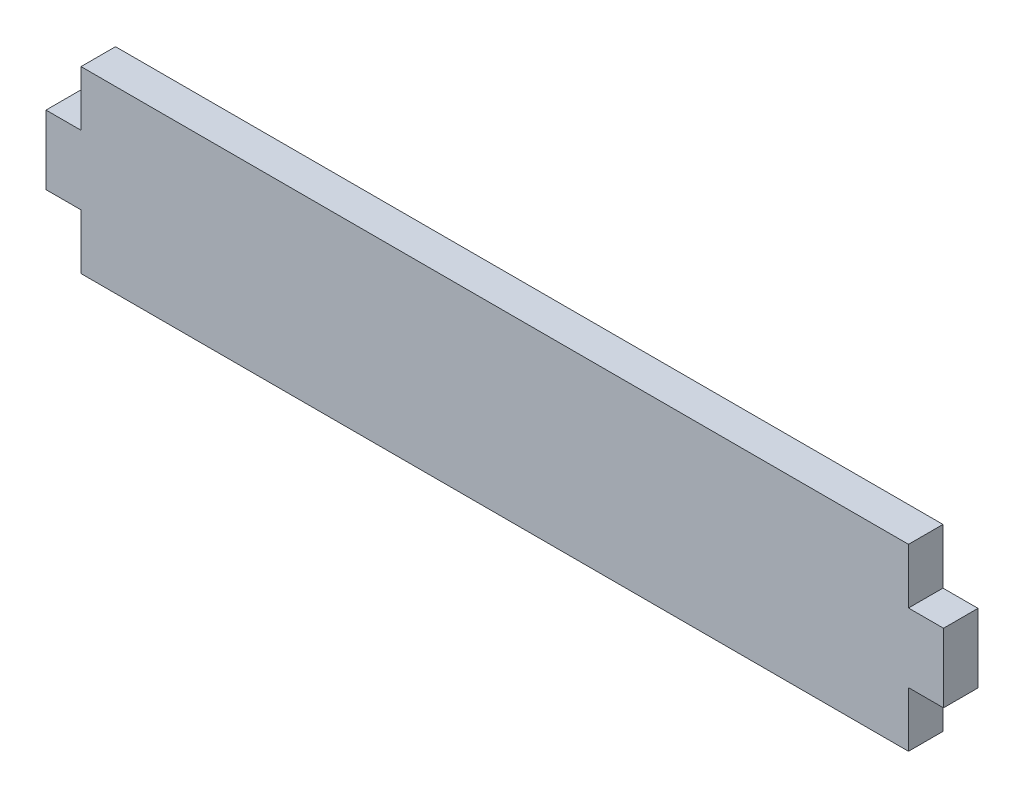
ISO-10303-21;
HEADER;
FILE_DESCRIPTION(('STEP AP214'),'2;1');
FILE_NAME('part.step','',(''),(''),'','','');
FILE_SCHEMA(('AUTOMOTIVE_DESIGN { 1 0 10303 214 1 1 1 1 }'));
ENDSEC;
DATA;
#1=APPLICATION_CONTEXT('core data for automotive mechanical design processes');
#2=APPLICATION_PROTOCOL_DEFINITION('international standard','automotive_design',2000,#1);
#3=PRODUCT_CONTEXT('',#1,'mechanical');
#4=PRODUCT('Part','Part','',(#3));
#5=PRODUCT_RELATED_PRODUCT_CATEGORY('part','',(#4));
#6=PRODUCT_DEFINITION_FORMATION('','',#4);
#7=PRODUCT_DEFINITION_CONTEXT('part definition',#1,'design');
#8=PRODUCT_DEFINITION('design','',#6,#7);
#9=PRODUCT_DEFINITION_SHAPE('','',#8);
#10=(LENGTH_UNIT() NAMED_UNIT(*) SI_UNIT(.MILLI.,.METRE.));
#11=(NAMED_UNIT(*) PLANE_ANGLE_UNIT() SI_UNIT($,.RADIAN.));
#12=(NAMED_UNIT(*) SI_UNIT($,.STERADIAN.) SOLID_ANGLE_UNIT());
#13=UNCERTAINTY_MEASURE_WITH_UNIT(LENGTH_MEASURE(1.E-05),#10,'distance_accuracy_value','');
#14=(GEOMETRIC_REPRESENTATION_CONTEXT(3) GLOBAL_UNCERTAINTY_ASSIGNED_CONTEXT((#13)) GLOBAL_UNIT_ASSIGNED_CONTEXT((#10,
#11,#12)) REPRESENTATION_CONTEXT('',''));
#15=CARTESIAN_POINT('',(0.,0.,0.));
#16=DIRECTION('',(0.,0.,1.));
#17=DIRECTION('',(1.,0.,0.));
#18=AXIS2_PLACEMENT_3D('',#15,#16,#17);
#19=CARTESIAN_POINT('',(38.1,-8.255,3.175));
#20=DIRECTION('',(-1.,0.,0.));
#21=DIRECTION('',(0.,0.,1.));
#22=AXIS2_PLACEMENT_3D('',#19,#20,#21);
#23=PLANE('',#22);
#24=DIRECTION('',(0.,0.,1.));
#25=VECTOR('',#24,1.);
#26=CARTESIAN_POINT('',(38.1,3.175,0.));
#27=LINE('',#26,#25);
#28=CARTESIAN_POINT('',(38.1,3.175,0.));
#29=VERTEX_POINT('',#28);
#30=CARTESIAN_POINT('',(38.1,3.175,3.175));
#31=VERTEX_POINT('',#30);
#32=EDGE_CURVE('E246',#29,#31,#27,.T.);
#33=ORIENTED_EDGE('',*,*,#32,.F.);
#34=DIRECTION('',(0.,1.,0.));
#35=VECTOR('',#34,1.);
#36=CARTESIAN_POINT('',(38.1,-8.255,0.));
#37=LINE('',#36,#35);
#38=CARTESIAN_POINT('',(38.1,8.255,0.));
#39=VERTEX_POINT('',#38);
#40=EDGE_CURVE('E148',#29,#39,#37,.T.);
#41=ORIENTED_EDGE('',*,*,#40,.T.);
#42=DIRECTION('',(0.,0.,-1.));
#43=VECTOR('',#42,1.);
#44=CARTESIAN_POINT('',(38.1,8.255,3.175));
#45=LINE('',#44,#43);
#46=CARTESIAN_POINT('',(38.1,8.255,3.175));
#47=VERTEX_POINT('',#46);
#48=EDGE_CURVE('E11',#47,#39,#45,.T.);
#49=ORIENTED_EDGE('',*,*,#48,.F.);
#50=DIRECTION('',(0.,1.,0.));
#51=VECTOR('',#50,1.);
#52=CARTESIAN_POINT('',(38.1,-8.255,3.175));
#53=LINE('',#52,#51);
#54=EDGE_CURVE('E200',#31,#47,#53,.T.);
#55=ORIENTED_EDGE('',*,*,#54,.F.);
#56=EDGE_LOOP('',(#33,#41,#49,#55));
#57=FACE_BOUND('',#56,.T.);
#58=ADVANCED_FACE('F33',(#57),#23,.F.);
#59=CARTESIAN_POINT('',(-38.1,-8.255,3.175));
#60=DIRECTION('',(1.,0.,0.));
#61=DIRECTION('',(0.,0.,-1.));
#62=AXIS2_PLACEMENT_3D('',#59,#60,#61);
#63=PLANE('',#62);
#64=DIRECTION('',(0.,0.,1.));
#65=VECTOR('',#64,1.);
#66=CARTESIAN_POINT('',(-38.1,-3.175,0.));
#67=LINE('',#66,#65);
#68=CARTESIAN_POINT('',(-38.1,-3.175,0.));
#69=VERTEX_POINT('',#68);
#70=CARTESIAN_POINT('',(-38.1,-3.175,3.175));
#71=VERTEX_POINT('',#70);
#72=EDGE_CURVE('E152',#69,#71,#67,.T.);
#73=ORIENTED_EDGE('',*,*,#72,.F.);
#74=DIRECTION('',(0.,-1.,0.));
#75=VECTOR('',#74,1.);
#76=CARTESIAN_POINT('',(-38.1,-8.255,0.));
#77=LINE('',#76,#75);
#78=CARTESIAN_POINT('',(-38.1,-8.255,0.));
#79=VERTEX_POINT('',#78);
#80=EDGE_CURVE('E150',#69,#79,#77,.T.);
#81=ORIENTED_EDGE('',*,*,#80,.T.);
#82=DIRECTION('',(0.,0.,-1.));
#83=VECTOR('',#82,1.);
#84=CARTESIAN_POINT('',(-38.1,-8.255,3.175));
#85=LINE('',#84,#83);
#86=CARTESIAN_POINT('',(-38.1,-8.255,3.175));
#87=VERTEX_POINT('',#86);
#88=EDGE_CURVE('E178',#87,#79,#85,.T.);
#89=ORIENTED_EDGE('',*,*,#88,.F.);
#90=DIRECTION('',(0.,-1.,0.));
#91=VECTOR('',#90,1.);
#92=CARTESIAN_POINT('',(-38.1,-8.255,3.175));
#93=LINE('',#92,#91);
#94=EDGE_CURVE('E184',#71,#87,#93,.T.);
#95=ORIENTED_EDGE('',*,*,#94,.F.);
#96=EDGE_LOOP('',(#73,#81,#89,#95));
#97=FACE_BOUND('',#96,.T.);
#98=ADVANCED_FACE('F213',(#97),#63,.F.);
#99=CARTESIAN_POINT('',(38.1,-8.255,0.));
#100=VERTEX_POINT('',#99);
#101=CARTESIAN_POINT('',(38.1,-3.175,0.));
#102=VERTEX_POINT('',#101);
#103=EDGE_CURVE('E130',#100,#102,#37,.T.);
#104=ORIENTED_EDGE('',*,*,#103,.T.);
#105=DIRECTION('',(0.,0.,1.));
#106=VECTOR('',#105,1.);
#107=CARTESIAN_POINT('',(38.1,-3.175,0.));
#108=LINE('',#107,#106);
#109=CARTESIAN_POINT('',(38.1,-3.175,3.175));
#110=VERTEX_POINT('',#109);
#111=EDGE_CURVE('E136',#102,#110,#108,.T.);
#112=ORIENTED_EDGE('',*,*,#111,.T.);
#113=CARTESIAN_POINT('',(38.1,-8.255,3.175));
#114=VERTEX_POINT('',#113);
#115=EDGE_CURVE('E193',#114,#110,#53,.T.);
#116=ORIENTED_EDGE('',*,*,#115,.F.);
#117=DIRECTION('',(0.,0.,-1.));
#118=VECTOR('',#117,1.);
#119=CARTESIAN_POINT('',(38.1,-8.255,3.175));
#120=LINE('',#119,#118);
#121=EDGE_CURVE('E146',#114,#100,#120,.T.);
#122=ORIENTED_EDGE('',*,*,#121,.T.);
#123=EDGE_LOOP('',(#104,#112,#116,#122));
#124=FACE_BOUND('',#123,.T.);
#125=ADVANCED_FACE('F35',(#124),#23,.F.);
#126=CARTESIAN_POINT('',(-38.1,8.255,3.175));
#127=DIRECTION('',(0.,-1.,0.));
#128=DIRECTION('',(0.,0.,-1.));
#129=AXIS2_PLACEMENT_3D('',#126,#127,#128);
#130=PLANE('',#129);
#131=DIRECTION('',(-1.,0.,0.));
#132=VECTOR('',#131,1.);
#133=CARTESIAN_POINT('',(-38.1,8.255,0.));
#134=LINE('',#133,#132);
#135=CARTESIAN_POINT('',(-38.1,8.255,0.));
#136=VERTEX_POINT('',#135);
#137=EDGE_CURVE('E147',#39,#136,#134,.T.);
#138=ORIENTED_EDGE('',*,*,#137,.T.);
#139=DIRECTION('',(0.,0.,-1.));
#140=VECTOR('',#139,1.);
#141=CARTESIAN_POINT('',(-38.1,8.255,3.175));
#142=LINE('',#141,#140);
#143=CARTESIAN_POINT('',(-38.1,8.255,3.175));
#144=VERTEX_POINT('',#143);
#145=EDGE_CURVE('E42',#144,#136,#142,.T.);
#146=ORIENTED_EDGE('',*,*,#145,.F.);
#147=DIRECTION('',(-1.,0.,0.));
#148=VECTOR('',#147,1.);
#149=CARTESIAN_POINT('',(-38.1,8.255,3.175));
#150=LINE('',#149,#148);
#151=EDGE_CURVE('E186',#47,#144,#150,.T.);
#152=ORIENTED_EDGE('',*,*,#151,.F.);
#153=ORIENTED_EDGE('',*,*,#48,.T.);
#154=EDGE_LOOP('',(#138,#146,#152,#153));
#155=FACE_BOUND('',#154,.T.);
#156=ADVANCED_FACE('F293',(#155),#130,.F.);
#157=CARTESIAN_POINT('',(-38.1,3.175,0.));
#158=VERTEX_POINT('',#157);
#159=EDGE_CURVE('E173',#136,#158,#77,.T.);
#160=ORIENTED_EDGE('',*,*,#159,.T.);
#161=DIRECTION('',(0.,0.,1.));
#162=VECTOR('',#161,1.);
#163=CARTESIAN_POINT('',(-38.1,3.175,0.));
#164=LINE('',#163,#162);
#165=CARTESIAN_POINT('',(-38.1,3.175,3.175));
#166=VERTEX_POINT('',#165);
#167=EDGE_CURVE('E232',#158,#166,#164,.T.);
#168=ORIENTED_EDGE('',*,*,#167,.T.);
#169=EDGE_CURVE('E180',#144,#166,#93,.T.);
#170=ORIENTED_EDGE('',*,*,#169,.F.);
#171=ORIENTED_EDGE('',*,*,#145,.T.);
#172=EDGE_LOOP('',(#160,#168,#170,#171));
#173=FACE_BOUND('',#172,.T.);
#174=ADVANCED_FACE('F283',(#173),#63,.F.);
#175=CARTESIAN_POINT('',(-38.1,-8.255,3.175));
#176=DIRECTION('',(0.,1.,0.));
#177=DIRECTION('',(0.,0.,1.));
#178=AXIS2_PLACEMENT_3D('',#175,#176,#177);
#179=PLANE('',#178);
#180=DIRECTION('',(1.,0.,0.));
#181=VECTOR('',#180,1.);
#182=CARTESIAN_POINT('',(-38.1,-8.255,0.));
#183=LINE('',#182,#181);
#184=EDGE_CURVE('E167',#79,#100,#183,.T.);
#185=ORIENTED_EDGE('',*,*,#184,.T.);
#186=ORIENTED_EDGE('',*,*,#121,.F.);
#187=DIRECTION('',(1.,0.,0.));
#188=VECTOR('',#187,1.);
#189=CARTESIAN_POINT('',(-38.1,-8.255,3.175));
#190=LINE('',#189,#188);
#191=EDGE_CURVE('E161',#87,#114,#190,.T.);
#192=ORIENTED_EDGE('',*,*,#191,.F.);
#193=ORIENTED_EDGE('',*,*,#88,.T.);
#194=EDGE_LOOP('',(#185,#186,#192,#193));
#195=FACE_BOUND('',#194,.T.);
#196=ADVANCED_FACE('F205',(#195),#179,.F.);
#197=CARTESIAN_POINT('',(38.1,8.255,3.175));
#198=DIRECTION('',(0.,0.,-1.));
#199=DIRECTION('',(-1.,0.,0.));
#200=AXIS2_PLACEMENT_3D('',#197,#198,#199);
#201=PLANE('',#200);
#202=ORIENTED_EDGE('',*,*,#115,.T.);
#203=DIRECTION('',(-1.,0.,0.));
#204=VECTOR('',#203,1.);
#205=CARTESIAN_POINT('',(41.3258,-3.175,3.175));
#206=LINE('',#205,#204);
#207=CARTESIAN_POINT('',(41.3258,-3.175,3.175));
#208=VERTEX_POINT('',#207);
#209=EDGE_CURVE('E50',#208,#110,#206,.T.);
#210=ORIENTED_EDGE('',*,*,#209,.F.);
#211=DIRECTION('',(0.,-1.,0.));
#212=VECTOR('',#211,1.);
#213=CARTESIAN_POINT('',(41.3258,3.175,3.175));
#214=LINE('',#213,#212);
#215=CARTESIAN_POINT('',(41.3258,3.175,3.175));
#216=VERTEX_POINT('',#215);
#217=EDGE_CURVE('E260',#216,#208,#214,.T.);
#218=ORIENTED_EDGE('',*,*,#217,.F.);
#219=DIRECTION('',(1.,0.,0.));
#220=VECTOR('',#219,1.);
#221=CARTESIAN_POINT('',(38.1,3.175,3.175));
#222=LINE('',#221,#220);
#223=EDGE_CURVE('E134',#31,#216,#222,.T.);
#224=ORIENTED_EDGE('',*,*,#223,.F.);
#225=ORIENTED_EDGE('',*,*,#54,.T.);
#226=ORIENTED_EDGE('',*,*,#151,.T.);
#227=ORIENTED_EDGE('',*,*,#169,.T.);
#228=DIRECTION('',(-1.,0.,0.));
#229=VECTOR('',#228,1.);
#230=CARTESIAN_POINT('',(-38.1,3.175,3.175));
#231=LINE('',#230,#229);
#232=CARTESIAN_POINT('',(-41.3258,3.175,3.175));
#233=VERTEX_POINT('',#232);
#234=EDGE_CURVE('E58',#166,#233,#231,.T.);
#235=ORIENTED_EDGE('',*,*,#234,.T.);
#236=DIRECTION('',(0.,-1.,0.));
#237=VECTOR('',#236,1.);
#238=CARTESIAN_POINT('',(-41.3258,3.175,3.175));
#239=LINE('',#238,#237);
#240=CARTESIAN_POINT('',(-41.3258,-3.175,3.175));
#241=VERTEX_POINT('',#240);
#242=EDGE_CURVE('E230',#233,#241,#239,.T.);
#243=ORIENTED_EDGE('',*,*,#242,.T.);
#244=DIRECTION('',(1.,0.,0.));
#245=VECTOR('',#244,1.);
#246=CARTESIAN_POINT('',(-41.3258,-3.175,3.175));
#247=LINE('',#246,#245);
#248=EDGE_CURVE('E241',#241,#71,#247,.T.);
#249=ORIENTED_EDGE('',*,*,#248,.T.);
#250=ORIENTED_EDGE('',*,*,#94,.T.);
#251=ORIENTED_EDGE('',*,*,#191,.T.);
#252=EDGE_LOOP('',(#202,#210,#218,#224,#225,#226,#227,#235,#243,#249,#250,#251));
#253=FACE_BOUND('',#252,.T.);
#254=ADVANCED_FACE('F274',(#253),#201,.F.);
#255=CARTESIAN_POINT('',(38.1,8.255,0.));
#256=DIRECTION('',(0.,0.,-1.));
#257=DIRECTION('',(-1.,0.,0.));
#258=AXIS2_PLACEMENT_3D('',#255,#256,#257);
#259=PLANE('',#258);
#260=ORIENTED_EDGE('',*,*,#103,.F.);
#261=ORIENTED_EDGE('',*,*,#184,.F.);
#262=ORIENTED_EDGE('',*,*,#80,.F.);
#263=DIRECTION('',(1.,0.,0.));
#264=VECTOR('',#263,1.);
#265=CARTESIAN_POINT('',(-41.3258,-3.175,0.));
#266=LINE('',#265,#264);
#267=CARTESIAN_POINT('',(-41.3258,-3.175,0.));
#268=VERTEX_POINT('',#267);
#269=EDGE_CURVE('E210',#268,#69,#266,.T.);
#270=ORIENTED_EDGE('',*,*,#269,.F.);
#271=DIRECTION('',(0.,-1.,0.));
#272=VECTOR('',#271,1.);
#273=CARTESIAN_POINT('',(-41.3258,3.175,0.));
#274=LINE('',#273,#272);
#275=CARTESIAN_POINT('',(-41.3258,3.175,0.));
#276=VERTEX_POINT('',#275);
#277=EDGE_CURVE('E237',#276,#268,#274,.T.);
#278=ORIENTED_EDGE('',*,*,#277,.F.);
#279=DIRECTION('',(-1.,0.,0.));
#280=VECTOR('',#279,1.);
#281=CARTESIAN_POINT('',(-38.1,3.175,0.));
#282=LINE('',#281,#280);
#283=EDGE_CURVE('E240',#158,#276,#282,.T.);
#284=ORIENTED_EDGE('',*,*,#283,.F.);
#285=ORIENTED_EDGE('',*,*,#159,.F.);
#286=ORIENTED_EDGE('',*,*,#137,.F.);
#287=ORIENTED_EDGE('',*,*,#40,.F.);
#288=DIRECTION('',(1.,0.,0.));
#289=VECTOR('',#288,1.);
#290=CARTESIAN_POINT('',(38.1,3.175,0.));
#291=LINE('',#290,#289);
#292=CARTESIAN_POINT('',(41.3258,3.175,0.));
#293=VERTEX_POINT('',#292);
#294=EDGE_CURVE('E142',#29,#293,#291,.T.);
#295=ORIENTED_EDGE('',*,*,#294,.T.);
#296=DIRECTION('',(0.,-1.,0.));
#297=VECTOR('',#296,1.);
#298=CARTESIAN_POINT('',(41.3258,3.175,0.));
#299=LINE('',#298,#297);
#300=CARTESIAN_POINT('',(41.3258,-3.175,0.));
#301=VERTEX_POINT('',#300);
#302=EDGE_CURVE('E132',#293,#301,#299,.T.);
#303=ORIENTED_EDGE('',*,*,#302,.T.);
#304=DIRECTION('',(-1.,0.,0.));
#305=VECTOR('',#304,1.);
#306=CARTESIAN_POINT('',(41.3258,-3.175,0.));
#307=LINE('',#306,#305);
#308=EDGE_CURVE('E126',#301,#102,#307,.T.);
#309=ORIENTED_EDGE('',*,*,#308,.T.);
#310=EDGE_LOOP('',(#260,#261,#262,#270,#278,#284,#285,#286,#287,#295,#303,#309));
#311=FACE_BOUND('',#310,.T.);
#312=ADVANCED_FACE('F127',(#311),#259,.T.);
#313=CARTESIAN_POINT('',(-41.3258,-3.175,0.));
#314=DIRECTION('',(0.,-1.,0.));
#315=DIRECTION('',(0.,0.,-1.));
#316=AXIS2_PLACEMENT_3D('',#313,#314,#315);
#317=PLANE('',#316);
#318=ORIENTED_EDGE('',*,*,#248,.F.);
#319=DIRECTION('',(0.,0.,1.));
#320=VECTOR('',#319,1.);
#321=CARTESIAN_POINT('',(-41.3258,-3.175,0.));
#322=LINE('',#321,#320);
#323=EDGE_CURVE('E218',#268,#241,#322,.T.);
#324=ORIENTED_EDGE('',*,*,#323,.F.);
#325=ORIENTED_EDGE('',*,*,#269,.T.);
#326=ORIENTED_EDGE('',*,*,#72,.T.);
#327=EDGE_LOOP('',(#318,#324,#325,#326));
#328=FACE_BOUND('',#327,.T.);
#329=ADVANCED_FACE('F281',(#328),#317,.T.);
#330=CARTESIAN_POINT('',(-41.3258,3.175,0.));
#331=DIRECTION('',(-1.,0.,0.));
#332=DIRECTION('',(0.,0.,1.));
#333=AXIS2_PLACEMENT_3D('',#330,#331,#332);
#334=PLANE('',#333);
#335=ORIENTED_EDGE('',*,*,#242,.F.);
#336=DIRECTION('',(0.,0.,1.));
#337=VECTOR('',#336,1.);
#338=CARTESIAN_POINT('',(-41.3258,3.175,0.));
#339=LINE('',#338,#337);
#340=EDGE_CURVE('E220',#276,#233,#339,.T.);
#341=ORIENTED_EDGE('',*,*,#340,.F.);
#342=ORIENTED_EDGE('',*,*,#277,.T.);
#343=ORIENTED_EDGE('',*,*,#323,.T.);
#344=EDGE_LOOP('',(#335,#341,#342,#343));
#345=FACE_BOUND('',#344,.T.);
#346=ADVANCED_FACE('F307',(#345),#334,.T.);
#347=CARTESIAN_POINT('',(-38.1,3.175,0.));
#348=DIRECTION('',(0.,1.,0.));
#349=DIRECTION('',(-1.,0.,0.));
#350=AXIS2_PLACEMENT_3D('',#347,#348,#349);
#351=PLANE('',#350);
#352=ORIENTED_EDGE('',*,*,#234,.F.);
#353=ORIENTED_EDGE('',*,*,#167,.F.);
#354=ORIENTED_EDGE('',*,*,#283,.T.);
#355=ORIENTED_EDGE('',*,*,#340,.T.);
#356=EDGE_LOOP('',(#352,#353,#354,#355));
#357=FACE_BOUND('',#356,.T.);
#358=ADVANCED_FACE('F313',(#357),#351,.T.);
#359=CARTESIAN_POINT('',(38.1,3.175,0.));
#360=DIRECTION('',(0.,-1.,0.));
#361=DIRECTION('',(1.,0.,0.));
#362=AXIS2_PLACEMENT_3D('',#359,#360,#361);
#363=PLANE('',#362);
#364=ORIENTED_EDGE('',*,*,#223,.T.);
#365=DIRECTION('',(0.,0.,1.));
#366=VECTOR('',#365,1.);
#367=CARTESIAN_POINT('',(41.3258,3.175,0.));
#368=LINE('',#367,#366);
#369=EDGE_CURVE('E247',#293,#216,#368,.T.);
#370=ORIENTED_EDGE('',*,*,#369,.F.);
#371=ORIENTED_EDGE('',*,*,#294,.F.);
#372=ORIENTED_EDGE('',*,*,#32,.T.);
#373=EDGE_LOOP('',(#364,#370,#371,#372));
#374=FACE_BOUND('',#373,.T.);
#375=ADVANCED_FACE('F272',(#374),#363,.F.);
#376=CARTESIAN_POINT('',(41.3258,3.175,0.));
#377=DIRECTION('',(-1.,0.,0.));
#378=DIRECTION('',(0.,0.,1.));
#379=AXIS2_PLACEMENT_3D('',#376,#377,#378);
#380=PLANE('',#379);
#381=ORIENTED_EDGE('',*,*,#217,.T.);
#382=DIRECTION('',(0.,0.,1.));
#383=VECTOR('',#382,1.);
#384=CARTESIAN_POINT('',(41.3258,-3.175,0.));
#385=LINE('',#384,#383);
#386=EDGE_CURVE('E141',#301,#208,#385,.T.);
#387=ORIENTED_EDGE('',*,*,#386,.F.);
#388=ORIENTED_EDGE('',*,*,#302,.F.);
#389=ORIENTED_EDGE('',*,*,#369,.T.);
#390=EDGE_LOOP('',(#381,#387,#388,#389));
#391=FACE_BOUND('',#390,.T.);
#392=ADVANCED_FACE('F273',(#391),#380,.F.);
#393=CARTESIAN_POINT('',(41.3258,-3.175,0.));
#394=DIRECTION('',(0.,1.,0.));
#395=DIRECTION('',(0.,0.,1.));
#396=AXIS2_PLACEMENT_3D('',#393,#394,#395);
#397=PLANE('',#396);
#398=ORIENTED_EDGE('',*,*,#209,.T.);
#399=ORIENTED_EDGE('',*,*,#111,.F.);
#400=ORIENTED_EDGE('',*,*,#308,.F.);
#401=ORIENTED_EDGE('',*,*,#386,.T.);
#402=EDGE_LOOP('',(#398,#399,#400,#401));
#403=FACE_BOUND('',#402,.T.);
#404=ADVANCED_FACE('F137',(#403),#397,.F.);
#405=CLOSED_SHELL('',(#58,#98,#125,#156,#174,#196,#254,#312,#329,#346,#358,#375,#392,#404));
#406=MANIFOLD_SOLID_BREP('B2',#405);
#407=ADVANCED_BREP_SHAPE_REPRESENTATION('',(#18,#406),#14);
#408=SHAPE_DEFINITION_REPRESENTATION(#9,#407);
ENDSEC;
END-ISO-10303-21;
